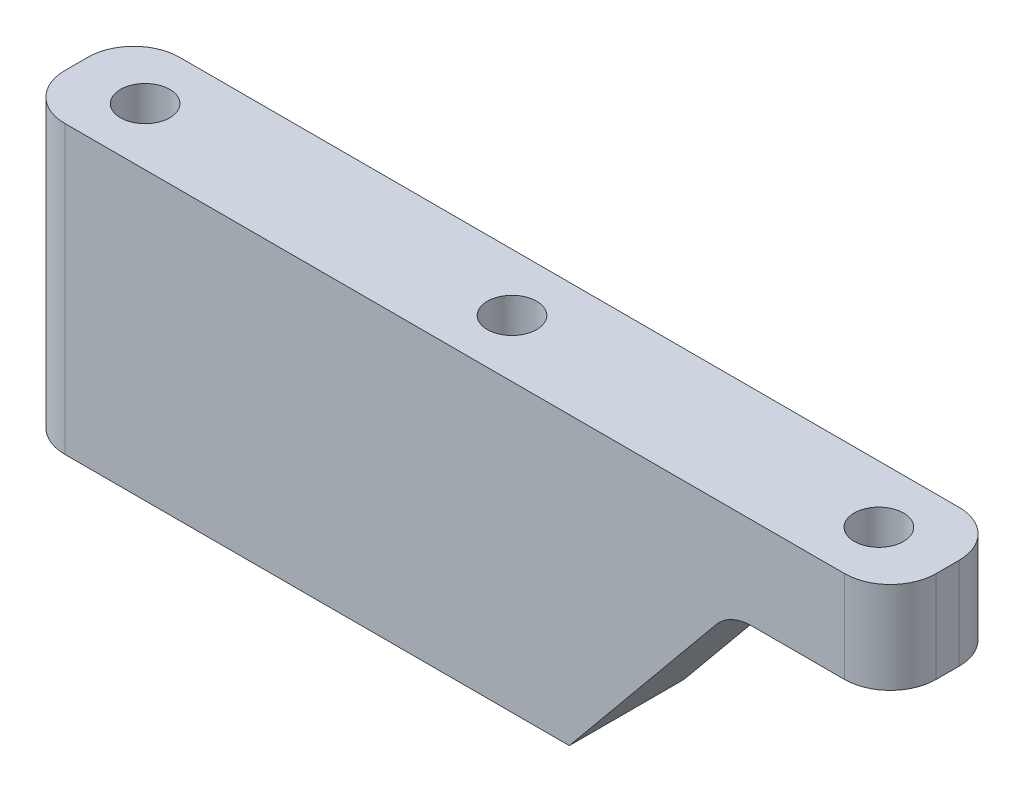
ISO-10303-21;
HEADER;
FILE_DESCRIPTION(('STEP AP214'),'2;1');
FILE_NAME('part.step','',(''),(''),'','','');
FILE_SCHEMA(('AUTOMOTIVE_DESIGN { 1 0 10303 214 1 1 1 1 }'));
ENDSEC;
DATA;
#1=APPLICATION_CONTEXT('core data for automotive mechanical design processes');
#2=APPLICATION_PROTOCOL_DEFINITION('international standard','automotive_design',2000,#1);
#3=PRODUCT_CONTEXT('',#1,'mechanical');
#4=PRODUCT('Part','Part','',(#3));
#5=PRODUCT_RELATED_PRODUCT_CATEGORY('part','',(#4));
#6=PRODUCT_DEFINITION_FORMATION('','',#4);
#7=PRODUCT_DEFINITION_CONTEXT('part definition',#1,'design');
#8=PRODUCT_DEFINITION('design','',#6,#7);
#9=PRODUCT_DEFINITION_SHAPE('','',#8);
#10=(LENGTH_UNIT() NAMED_UNIT(*) SI_UNIT(.MILLI.,.METRE.));
#11=(NAMED_UNIT(*) PLANE_ANGLE_UNIT() SI_UNIT($,.RADIAN.));
#12=(NAMED_UNIT(*) SI_UNIT($,.STERADIAN.) SOLID_ANGLE_UNIT());
#13=UNCERTAINTY_MEASURE_WITH_UNIT(LENGTH_MEASURE(1.E-05),#10,'distance_accuracy_value','');
#14=(GEOMETRIC_REPRESENTATION_CONTEXT(3) GLOBAL_UNCERTAINTY_ASSIGNED_CONTEXT((#13)) GLOBAL_UNIT_ASSIGNED_CONTEXT((#10,
#11,#12)) REPRESENTATION_CONTEXT('',''));
#15=CARTESIAN_POINT('',(0.,0.,0.));
#16=DIRECTION('',(0.,0.,1.));
#17=DIRECTION('',(1.,0.,0.));
#18=AXIS2_PLACEMENT_3D('',#15,#16,#17);
#19=CARTESIAN_POINT('',(0.,25.,0.));
#20=DIRECTION('',(0.,-1.,0.));
#21=DIRECTION('',(0.,0.,-1.));
#22=AXIS2_PLACEMENT_3D('',#19,#20,#21);
#23=PLANE('',#22);
#24=DIRECTION('',(-1.,0.,0.));
#25=VECTOR('',#24,1.);
#26=CARTESIAN_POINT('',(-38.,25.,-5.));
#27=LINE('',#26,#25);
#28=CARTESIAN_POINT('',(34.,25.,-5.));
#29=VERTEX_POINT('',#28);
#30=CARTESIAN_POINT('',(-34.,25.,-5.));
#31=VERTEX_POINT('',#30);
#32=EDGE_CURVE('E178',#29,#31,#27,.T.);
#33=ORIENTED_EDGE('',*,*,#32,.T.);
#34=CARTESIAN_POINT('',(-34.,25.,-1.));
#35=DIRECTION('',(0.,-1.,0.));
#36=DIRECTION('',(0.,0.,-1.));
#37=AXIS2_PLACEMENT_3D('',#34,#35,#36);
#38=CIRCLE('',#37,4.);
#39=CARTESIAN_POINT('',(-38.,25.,-1.));
#40=VERTEX_POINT('',#39);
#41=EDGE_CURVE('E210',#31,#40,#38,.F.);
#42=ORIENTED_EDGE('',*,*,#41,.T.);
#43=DIRECTION('',(0.,0.,1.));
#44=VECTOR('',#43,1.);
#45=CARTESIAN_POINT('',(-38.,25.,5.));
#46=LINE('',#45,#44);
#47=CARTESIAN_POINT('',(-38.,25.,0.999999999999999));
#48=VERTEX_POINT('',#47);
#49=EDGE_CURVE('E181',#40,#48,#46,.T.);
#50=ORIENTED_EDGE('',*,*,#49,.T.);
#51=CARTESIAN_POINT('',(-34.,25.,0.999999999999999));
#52=DIRECTION('',(0.,-1.,0.));
#53=DIRECTION('',(0.,0.,-1.));
#54=AXIS2_PLACEMENT_3D('',#51,#52,#53);
#55=CIRCLE('',#54,4.);
#56=CARTESIAN_POINT('',(-34.,25.,5.));
#57=VERTEX_POINT('',#56);
#58=EDGE_CURVE('E208',#48,#57,#55,.F.);
#59=ORIENTED_EDGE('',*,*,#58,.T.);
#60=DIRECTION('',(1.,0.,0.));
#61=VECTOR('',#60,1.);
#62=CARTESIAN_POINT('',(-38.,25.,5.));
#63=LINE('',#62,#61);
#64=CARTESIAN_POINT('',(34.,25.,5.));
#65=VERTEX_POINT('',#64);
#66=EDGE_CURVE('E184',#57,#65,#63,.T.);
#67=ORIENTED_EDGE('',*,*,#66,.T.);
#68=CARTESIAN_POINT('',(34.,25.,0.999999999999999));
#69=DIRECTION('',(0.,-1.,0.));
#70=DIRECTION('',(0.,0.,-1.));
#71=AXIS2_PLACEMENT_3D('',#68,#69,#70);
#72=CIRCLE('',#71,4.);
#73=CARTESIAN_POINT('',(38.,25.,0.999999999999999));
#74=VERTEX_POINT('',#73);
#75=EDGE_CURVE('E204',#65,#74,#72,.F.);
#76=ORIENTED_EDGE('',*,*,#75,.T.);
#77=DIRECTION('',(0.,0.,-1.));
#78=VECTOR('',#77,1.);
#79=CARTESIAN_POINT('',(38.,25.,5.));
#80=LINE('',#79,#78);
#81=CARTESIAN_POINT('',(38.,25.,-1.));
#82=VERTEX_POINT('',#81);
#83=EDGE_CURVE('E141',#74,#82,#80,.T.);
#84=ORIENTED_EDGE('',*,*,#83,.T.);
#85=CARTESIAN_POINT('',(34.,25.,-1.));
#86=DIRECTION('',(0.,-1.,0.));
#87=DIRECTION('',(0.,0.,-1.));
#88=AXIS2_PLACEMENT_3D('',#85,#86,#87);
#89=CIRCLE('',#88,4.);
#90=EDGE_CURVE('E206',#82,#29,#89,.F.);
#91=ORIENTED_EDGE('',*,*,#90,.T.);
#92=EDGE_LOOP('',(#33,#42,#50,#59,#67,#76,#84,#91));
#93=FACE_BOUND('',#92,.T.);
#94=CARTESIAN_POINT('',(0.,25.,0.));
#95=DIRECTION('',(0.,1.,0.));
#96=DIRECTION('',(0.,0.,1.));
#97=AXIS2_PLACEMENT_3D('',#94,#95,#96);
#98=CIRCLE('',#97,2.15);
#99=CARTESIAN_POINT('',(0.,25.,2.15));
#100=VERTEX_POINT('',#99);
#101=EDGE_CURVE('E171',#100,#100,#98,.T.);
#102=ORIENTED_EDGE('',*,*,#101,.F.);
#103=EDGE_LOOP('',(#102));
#104=FACE_BOUND('',#103,.T.);
#105=CARTESIAN_POINT('',(-32.,25.,0.));
#106=DIRECTION('',(0.,1.,0.));
#107=DIRECTION('',(0.,0.,1.));
#108=AXIS2_PLACEMENT_3D('',#105,#106,#107);
#109=CIRCLE('',#108,2.15);
#110=CARTESIAN_POINT('',(-32.,25.,2.15));
#111=VERTEX_POINT('',#110);
#112=EDGE_CURVE('E165',#111,#111,#109,.T.);
#113=ORIENTED_EDGE('',*,*,#112,.F.);
#114=EDGE_LOOP('',(#113));
#115=FACE_BOUND('',#114,.T.);
#116=CARTESIAN_POINT('',(32.,25.,0.));
#117=DIRECTION('',(0.,1.,0.));
#118=DIRECTION('',(0.,0.,1.));
#119=AXIS2_PLACEMENT_3D('',#116,#117,#118);
#120=CIRCLE('',#119,2.15);
#121=CARTESIAN_POINT('',(32.,25.,2.14999999999999));
#122=VERTEX_POINT('',#121);
#123=EDGE_CURVE('E161',#122,#122,#120,.T.);
#124=ORIENTED_EDGE('',*,*,#123,.F.);
#125=EDGE_LOOP('',(#124));
#126=FACE_BOUND('',#125,.T.);
#127=ADVANCED_FACE('F35',(#93,#104,#115,#126),#23,.F.);
#128=CARTESIAN_POINT('',(0.,0.,0.));
#129=DIRECTION('',(0.,-1.,0.));
#130=DIRECTION('',(0.,0.,-1.));
#131=AXIS2_PLACEMENT_3D('',#128,#129,#130);
#132=PLANE('',#131);
#133=DIRECTION('',(0.,0.,1.));
#134=VECTOR('',#133,1.);
#135=CARTESIAN_POINT('',(-38.,0.,5.));
#136=LINE('',#135,#134);
#137=CARTESIAN_POINT('',(-38.,0.,-1.));
#138=VERTEX_POINT('',#137);
#139=CARTESIAN_POINT('',(-38.,0.,0.999999999999999));
#140=VERTEX_POINT('',#139);
#141=EDGE_CURVE('E142',#138,#140,#136,.T.);
#142=ORIENTED_EDGE('',*,*,#141,.F.);
#143=CARTESIAN_POINT('',(-34.,0.,-1.));
#144=DIRECTION('',(0.,-1.,0.));
#145=DIRECTION('',(0.,0.,-1.));
#146=AXIS2_PLACEMENT_3D('',#143,#144,#145);
#147=CIRCLE('',#146,4.);
#148=CARTESIAN_POINT('',(-34.,0.,-5.));
#149=VERTEX_POINT('',#148);
#150=EDGE_CURVE('E197',#138,#149,#147,.T.);
#151=ORIENTED_EDGE('',*,*,#150,.T.);
#152=DIRECTION('',(-1.,0.,0.));
#153=VECTOR('',#152,1.);
#154=CARTESIAN_POINT('',(-38.,0.,-5.));
#155=LINE('',#154,#153);
#156=CARTESIAN_POINT('',(10.,0.,-5.));
#157=VERTEX_POINT('',#156);
#158=EDGE_CURVE('E148',#157,#149,#155,.T.);
#159=ORIENTED_EDGE('',*,*,#158,.F.);
#160=DIRECTION('',(0.,0.,1.));
#161=VECTOR('',#160,1.);
#162=CARTESIAN_POINT('',(10.,0.,-22.));
#163=LINE('',#162,#161);
#164=CARTESIAN_POINT('',(10.,0.,5.));
#165=VERTEX_POINT('',#164);
#166=EDGE_CURVE('E125',#157,#165,#163,.T.);
#167=ORIENTED_EDGE('',*,*,#166,.T.);
#168=DIRECTION('',(1.,0.,0.));
#169=VECTOR('',#168,1.);
#170=CARTESIAN_POINT('',(-38.,0.,5.));
#171=LINE('',#170,#169);
#172=CARTESIAN_POINT('',(-34.,0.,5.));
#173=VERTEX_POINT('',#172);
#174=EDGE_CURVE('E135',#173,#165,#171,.T.);
#175=ORIENTED_EDGE('',*,*,#174,.F.);
#176=CARTESIAN_POINT('',(-34.,0.,0.999999999999999));
#177=DIRECTION('',(0.,-1.,0.));
#178=DIRECTION('',(0.,0.,-1.));
#179=AXIS2_PLACEMENT_3D('',#176,#177,#178);
#180=CIRCLE('',#179,4.);
#181=EDGE_CURVE('E195',#173,#140,#180,.T.);
#182=ORIENTED_EDGE('',*,*,#181,.T.);
#183=EDGE_LOOP('',(#142,#151,#159,#167,#175,#182));
#184=FACE_BOUND('',#183,.T.);
#185=CARTESIAN_POINT('',(-32.,0.,0.));
#186=DIRECTION('',(0.,1.,0.));
#187=DIRECTION('',(0.,0.,1.));
#188=AXIS2_PLACEMENT_3D('',#185,#186,#187);
#189=CIRCLE('',#188,2.15);
#190=CARTESIAN_POINT('',(-32.,0.,2.15));
#191=VERTEX_POINT('',#190);
#192=EDGE_CURVE('E164',#191,#191,#189,.T.);
#193=ORIENTED_EDGE('',*,*,#192,.T.);
#194=EDGE_LOOP('',(#193));
#195=FACE_BOUND('',#194,.T.);
#196=CARTESIAN_POINT('',(0.,0.,0.));
#197=DIRECTION('',(0.,1.,0.));
#198=DIRECTION('',(0.,0.,1.));
#199=AXIS2_PLACEMENT_3D('',#196,#197,#198);
#200=CIRCLE('',#199,2.15);
#201=CARTESIAN_POINT('',(0.,0.,2.15));
#202=VERTEX_POINT('',#201);
#203=EDGE_CURVE('E168',#202,#202,#200,.T.);
#204=ORIENTED_EDGE('',*,*,#203,.T.);
#205=EDGE_LOOP('',(#204));
#206=FACE_BOUND('',#205,.T.);
#207=ADVANCED_FACE('F145',(#184,#195,#206),#132,.T.);
#208=CARTESIAN_POINT('',(38.,25.,5.));
#209=DIRECTION('',(-1.,0.,0.));
#210=DIRECTION('',(0.,0.,1.));
#211=AXIS2_PLACEMENT_3D('',#208,#209,#210);
#212=PLANE('',#211);
#213=DIRECTION('',(0.,0.,1.));
#214=VECTOR('',#213,1.);
#215=CARTESIAN_POINT('',(38.,17.,-22.));
#216=LINE('',#215,#214);
#217=CARTESIAN_POINT('',(38.,17.,-1.));
#218=VERTEX_POINT('',#217);
#219=CARTESIAN_POINT('',(38.,17.,1.));
#220=VERTEX_POINT('',#219);
#221=EDGE_CURVE('E130',#218,#220,#216,.T.);
#222=ORIENTED_EDGE('',*,*,#221,.F.);
#223=DIRECTION('',(0.,-1.,0.));
#224=VECTOR('',#223,1.);
#225=CARTESIAN_POINT('',(38.,25.,-1.));
#226=LINE('',#225,#224);
#227=EDGE_CURVE('E221',#218,#82,#226,.F.);
#228=ORIENTED_EDGE('',*,*,#227,.T.);
#229=ORIENTED_EDGE('',*,*,#83,.F.);
#230=DIRECTION('',(0.,-1.,0.));
#231=VECTOR('',#230,1.);
#232=CARTESIAN_POINT('',(38.,25.,0.999999999999999));
#233=LINE('',#232,#231);
#234=EDGE_CURVE('E219',#74,#220,#233,.T.);
#235=ORIENTED_EDGE('',*,*,#234,.T.);
#236=EDGE_LOOP('',(#222,#228,#229,#235));
#237=FACE_BOUND('',#236,.T.);
#238=ADVANCED_FACE('F239',(#237),#212,.F.);
#239=CARTESIAN_POINT('',(-38.,25.,-5.));
#240=DIRECTION('',(0.,0.,1.));
#241=DIRECTION('',(1.,0.,0.));
#242=AXIS2_PLACEMENT_3D('',#239,#240,#241);
#243=PLANE('',#242);
#244=ORIENTED_EDGE('',*,*,#158,.T.);
#245=DIRECTION('',(0.,-1.,0.));
#246=VECTOR('',#245,1.);
#247=CARTESIAN_POINT('',(-34.,25.,-5.));
#248=LINE('',#247,#246);
#249=EDGE_CURVE('E202',#149,#31,#248,.F.);
#250=ORIENTED_EDGE('',*,*,#249,.T.);
#251=ORIENTED_EDGE('',*,*,#32,.F.);
#252=DIRECTION('',(0.,-1.,0.));
#253=VECTOR('',#252,1.);
#254=CARTESIAN_POINT('',(34.,25.,-5.));
#255=LINE('',#254,#253);
#256=CARTESIAN_POINT('',(34.,17.,-5.));
#257=VERTEX_POINT('',#256);
#258=EDGE_CURVE('E199',#29,#257,#255,.T.);
#259=ORIENTED_EDGE('',*,*,#258,.T.);
#260=DIRECTION('',(-1.,0.,0.));
#261=VECTOR('',#260,1.);
#262=CARTESIAN_POINT('',(-38.,17.,-5.));
#263=LINE('',#262,#261);
#264=CARTESIAN_POINT('',(25.8876977754224,17.,-5.));
#265=VERTEX_POINT('',#264);
#266=EDGE_CURVE('E152',#257,#265,#263,.T.);
#267=ORIENTED_EDGE('',*,*,#266,.T.);
#268=CARTESIAN_POINT('',(25.8876977754224,13.,-5.));
#269=DIRECTION('',(0.,0.,1.));
#270=DIRECTION('',(1.,0.,0.));
#271=AXIS2_PLACEMENT_3D('',#268,#269,#270);
#272=CIRCLE('',#271,4.);
#273=CARTESIAN_POINT('',(22.7999768329542,15.5428290114444,-5.));
#274=VERTEX_POINT('',#273);
#275=EDGE_CURVE('E11',#265,#274,#272,.T.);
#276=ORIENTED_EDGE('',*,*,#275,.T.);
#277=DIRECTION('',(-0.635707252861101,-0.771930235617049,0.));
#278=VECTOR('',#277,1.);
#279=CARTESIAN_POINT('',(2.87010309278347,-8.65773195876291,-5.));
#280=LINE('',#279,#278);
#281=EDGE_CURVE('E159',#274,#157,#280,.T.);
#282=ORIENTED_EDGE('',*,*,#281,.T.);
#283=EDGE_LOOP('',(#244,#250,#251,#259,#267,#276,#282));
#284=FACE_BOUND('',#283,.T.);
#285=ADVANCED_FACE('F230',(#284),#243,.F.);
#286=CARTESIAN_POINT('',(-38.,25.,5.));
#287=DIRECTION('',(1.,0.,0.));
#288=DIRECTION('',(0.,0.,-1.));
#289=AXIS2_PLACEMENT_3D('',#286,#287,#288);
#290=PLANE('',#289);
#291=ORIENTED_EDGE('',*,*,#49,.F.);
#292=DIRECTION('',(0.,-1.,0.));
#293=VECTOR('',#292,1.);
#294=CARTESIAN_POINT('',(-38.,25.,-1.));
#295=LINE('',#294,#293);
#296=EDGE_CURVE('E192',#40,#138,#295,.T.);
#297=ORIENTED_EDGE('',*,*,#296,.T.);
#298=ORIENTED_EDGE('',*,*,#141,.T.);
#299=DIRECTION('',(0.,-1.,0.));
#300=VECTOR('',#299,1.);
#301=CARTESIAN_POINT('',(-38.,25.,0.999999999999999));
#302=LINE('',#301,#300);
#303=EDGE_CURVE('E187',#140,#48,#302,.F.);
#304=ORIENTED_EDGE('',*,*,#303,.T.);
#305=EDGE_LOOP('',(#291,#297,#298,#304));
#306=FACE_BOUND('',#305,.T.);
#307=ADVANCED_FACE('F250',(#306),#290,.F.);
#308=CARTESIAN_POINT('',(-38.,25.,5.));
#309=DIRECTION('',(0.,0.,-1.));
#310=DIRECTION('',(-1.,0.,0.));
#311=AXIS2_PLACEMENT_3D('',#308,#309,#310);
#312=PLANE('',#311);
#313=ORIENTED_EDGE('',*,*,#66,.F.);
#314=DIRECTION('',(0.,-1.,0.));
#315=VECTOR('',#314,1.);
#316=CARTESIAN_POINT('',(-34.,25.,5.));
#317=LINE('',#316,#315);
#318=EDGE_CURVE('E139',#57,#173,#317,.T.);
#319=ORIENTED_EDGE('',*,*,#318,.T.);
#320=ORIENTED_EDGE('',*,*,#174,.T.);
#321=DIRECTION('',(-0.635707252861101,-0.771930235617049,0.));
#322=VECTOR('',#321,1.);
#323=CARTESIAN_POINT('',(24.,17.,5.));
#324=LINE('',#323,#322);
#325=CARTESIAN_POINT('',(22.7999768329542,15.5428290114444,5.));
#326=VERTEX_POINT('',#325);
#327=EDGE_CURVE('E120',#326,#165,#324,.T.);
#328=ORIENTED_EDGE('',*,*,#327,.F.);
#329=CARTESIAN_POINT('',(25.8876977754224,13.,5.));
#330=DIRECTION('',(0.,0.,-1.));
#331=DIRECTION('',(-1.,0.,0.));
#332=AXIS2_PLACEMENT_3D('',#329,#330,#331);
#333=CIRCLE('',#332,4.);
#334=CARTESIAN_POINT('',(25.8876977754224,17.,5.));
#335=VERTEX_POINT('',#334);
#336=EDGE_CURVE('E43',#326,#335,#333,.T.);
#337=ORIENTED_EDGE('',*,*,#336,.T.);
#338=DIRECTION('',(-1.,0.,0.));
#339=VECTOR('',#338,1.);
#340=CARTESIAN_POINT('',(38.,17.,5.));
#341=LINE('',#340,#339);
#342=CARTESIAN_POINT('',(34.,17.,5.));
#343=VERTEX_POINT('',#342);
#344=EDGE_CURVE('E131',#343,#335,#341,.T.);
#345=ORIENTED_EDGE('',*,*,#344,.F.);
#346=DIRECTION('',(0.,-1.,0.));
#347=VECTOR('',#346,1.);
#348=CARTESIAN_POINT('',(34.,25.,5.));
#349=LINE('',#348,#347);
#350=EDGE_CURVE('E212',#343,#65,#349,.F.);
#351=ORIENTED_EDGE('',*,*,#350,.T.);
#352=EDGE_LOOP('',(#313,#319,#320,#328,#337,#345,#351));
#353=FACE_BOUND('',#352,.T.);
#354=ADVANCED_FACE('F137',(#353),#312,.F.);
#355=CARTESIAN_POINT('',(0.,25.,0.));
#356=DIRECTION('',(0.,-1.,0.));
#357=DIRECTION('',(0.,0.,-1.));
#358=AXIS2_PLACEMENT_3D('',#355,#356,#357);
#359=CYLINDRICAL_SURFACE('',#358,2.15);
#360=ORIENTED_EDGE('',*,*,#101,.T.);
#361=EDGE_LOOP('',(#360));
#362=FACE_BOUND('',#361,.T.);
#363=ORIENTED_EDGE('',*,*,#203,.F.);
#364=EDGE_LOOP('',(#363));
#365=FACE_BOUND('',#364,.T.);
#366=ADVANCED_FACE('F273',(#362,#365),#359,.F.);
#367=CARTESIAN_POINT('',(-32.,25.,0.));
#368=DIRECTION('',(0.,-1.,0.));
#369=DIRECTION('',(0.,0.,-1.));
#370=AXIS2_PLACEMENT_3D('',#367,#368,#369);
#371=CYLINDRICAL_SURFACE('',#370,2.15);
#372=ORIENTED_EDGE('',*,*,#112,.T.);
#373=EDGE_LOOP('',(#372));
#374=FACE_BOUND('',#373,.T.);
#375=ORIENTED_EDGE('',*,*,#192,.F.);
#376=EDGE_LOOP('',(#375));
#377=FACE_BOUND('',#376,.T.);
#378=ADVANCED_FACE('F305',(#374,#377),#371,.F.);
#379=CARTESIAN_POINT('',(32.,25.,0.));
#380=DIRECTION('',(0.,-1.,0.));
#381=DIRECTION('',(0.,0.,-1.));
#382=AXIS2_PLACEMENT_3D('',#379,#380,#381);
#383=CYLINDRICAL_SURFACE('',#382,2.15);
#384=CARTESIAN_POINT('',(32.,17.,0.));
#385=DIRECTION('',(0.,1.,0.));
#386=DIRECTION('',(0.,0.,1.));
#387=AXIS2_PLACEMENT_3D('',#384,#385,#386);
#388=CIRCLE('',#387,2.15);
#389=CARTESIAN_POINT('',(32.,17.,2.14999999999999));
#390=VERTEX_POINT('',#389);
#391=EDGE_CURVE('E149',#390,#390,#388,.T.);
#392=ORIENTED_EDGE('',*,*,#391,.F.);
#393=EDGE_LOOP('',(#392));
#394=FACE_BOUND('',#393,.T.);
#395=ORIENTED_EDGE('',*,*,#123,.T.);
#396=EDGE_LOOP('',(#395));
#397=FACE_BOUND('',#396,.T.);
#398=ADVANCED_FACE('F312',(#394,#397),#383,.F.);
#399=CARTESIAN_POINT('',(24.,17.,-22.));
#400=DIRECTION('',(-0.771930235617049,0.635707252861101,0.));
#401=DIRECTION('',(-0.635707252861101,-0.771930235617049,0.));
#402=AXIS2_PLACEMENT_3D('',#399,#400,#401);
#403=PLANE('',#402);
#404=ORIENTED_EDGE('',*,*,#281,.F.);
#405=DIRECTION('',(0.,0.,1.));
#406=VECTOR('',#405,1.);
#407=CARTESIAN_POINT('',(22.7999768329542,15.5428290114444,5.));
#408=LINE('',#407,#406);
#409=EDGE_CURVE('E128',#274,#326,#408,.T.);
#410=ORIENTED_EDGE('',*,*,#409,.T.);
#411=ORIENTED_EDGE('',*,*,#327,.T.);
#412=ORIENTED_EDGE('',*,*,#166,.F.);
#413=EDGE_LOOP('',(#404,#410,#411,#412));
#414=FACE_BOUND('',#413,.T.);
#415=ADVANCED_FACE('F123',(#414),#403,.F.);
#416=CARTESIAN_POINT('',(38.,17.,-22.));
#417=DIRECTION('',(0.,1.,0.));
#418=DIRECTION('',(0.,0.,1.));
#419=AXIS2_PLACEMENT_3D('',#416,#417,#418);
#420=PLANE('',#419);
#421=ORIENTED_EDGE('',*,*,#391,.T.);
#422=EDGE_LOOP('',(#421));
#423=FACE_BOUND('',#422,.T.);
#424=ORIENTED_EDGE('',*,*,#266,.F.);
#425=CARTESIAN_POINT('',(34.,17.,-1.));
#426=DIRECTION('',(0.,1.,0.));
#427=DIRECTION('',(0.,0.,1.));
#428=AXIS2_PLACEMENT_3D('',#425,#426,#427);
#429=CIRCLE('',#428,4.);
#430=EDGE_CURVE('E58',#257,#218,#429,.F.);
#431=ORIENTED_EDGE('',*,*,#430,.T.);
#432=ORIENTED_EDGE('',*,*,#221,.T.);
#433=CARTESIAN_POINT('',(34.,17.,0.999999999999999));
#434=DIRECTION('',(0.,1.,0.));
#435=DIRECTION('',(0.,0.,1.));
#436=AXIS2_PLACEMENT_3D('',#433,#434,#435);
#437=CIRCLE('',#436,4.);
#438=EDGE_CURVE('E50',#220,#343,#437,.F.);
#439=ORIENTED_EDGE('',*,*,#438,.T.);
#440=ORIENTED_EDGE('',*,*,#344,.T.);
#441=DIRECTION('',(0.,0.,1.));
#442=VECTOR('',#441,1.);
#443=CARTESIAN_POINT('',(25.8876977754224,17.,-5.));
#444=LINE('',#443,#442);
#445=EDGE_CURVE('E215',#335,#265,#444,.F.);
#446=ORIENTED_EDGE('',*,*,#445,.T.);
#447=EDGE_LOOP('',(#424,#431,#432,#439,#440,#446));
#448=FACE_BOUND('',#447,.T.);
#449=ADVANCED_FACE('F227',(#423,#448),#420,.F.);
#450=CARTESIAN_POINT('',(-34.,25.,-1.));
#451=DIRECTION('',(0.,-1.,0.));
#452=DIRECTION('',(0.,0.,-1.));
#453=AXIS2_PLACEMENT_3D('',#450,#451,#452);
#454=CYLINDRICAL_SURFACE('',#453,4.);
#455=ORIENTED_EDGE('',*,*,#41,.F.);
#456=ORIENTED_EDGE('',*,*,#249,.F.);
#457=ORIENTED_EDGE('',*,*,#150,.F.);
#458=ORIENTED_EDGE('',*,*,#296,.F.);
#459=EDGE_LOOP('',(#455,#456,#457,#458));
#460=FACE_BOUND('',#459,.T.);
#461=ADVANCED_FACE('F254',(#460),#454,.T.);
#462=CARTESIAN_POINT('',(-34.,25.,0.999999999999999));
#463=DIRECTION('',(0.,-1.,0.));
#464=DIRECTION('',(0.,0.,-1.));
#465=AXIS2_PLACEMENT_3D('',#462,#463,#464);
#466=CYLINDRICAL_SURFACE('',#465,4.);
#467=ORIENTED_EDGE('',*,*,#58,.F.);
#468=ORIENTED_EDGE('',*,*,#303,.F.);
#469=ORIENTED_EDGE('',*,*,#181,.F.);
#470=ORIENTED_EDGE('',*,*,#318,.F.);
#471=EDGE_LOOP('',(#467,#468,#469,#470));
#472=FACE_BOUND('',#471,.T.);
#473=ADVANCED_FACE('F246',(#472),#466,.T.);
#474=CARTESIAN_POINT('',(34.,25.,-1.));
#475=DIRECTION('',(0.,-1.,0.));
#476=DIRECTION('',(0.,0.,-1.));
#477=AXIS2_PLACEMENT_3D('',#474,#475,#476);
#478=CYLINDRICAL_SURFACE('',#477,4.);
#479=ORIENTED_EDGE('',*,*,#90,.F.);
#480=ORIENTED_EDGE('',*,*,#227,.F.);
#481=ORIENTED_EDGE('',*,*,#430,.F.);
#482=ORIENTED_EDGE('',*,*,#258,.F.);
#483=EDGE_LOOP('',(#479,#480,#481,#482));
#484=FACE_BOUND('',#483,.T.);
#485=ADVANCED_FACE('F235',(#484),#478,.T.);
#486=CARTESIAN_POINT('',(34.,25.,0.999999999999999));
#487=DIRECTION('',(0.,-1.,0.));
#488=DIRECTION('',(0.,0.,-1.));
#489=AXIS2_PLACEMENT_3D('',#486,#487,#488);
#490=CYLINDRICAL_SURFACE('',#489,4.);
#491=ORIENTED_EDGE('',*,*,#75,.F.);
#492=ORIENTED_EDGE('',*,*,#350,.F.);
#493=ORIENTED_EDGE('',*,*,#438,.F.);
#494=ORIENTED_EDGE('',*,*,#234,.F.);
#495=EDGE_LOOP('',(#491,#492,#493,#494));
#496=FACE_BOUND('',#495,.T.);
#497=ADVANCED_FACE('F243',(#496),#490,.T.);
#498=CARTESIAN_POINT('',(25.8876977754224,13.,-22.));
#499=DIRECTION('',(0.,0.,-1.));
#500=DIRECTION('',(-1.,0.,0.));
#501=AXIS2_PLACEMENT_3D('',#498,#499,#500);
#502=CYLINDRICAL_SURFACE('',#501,4.);
#503=ORIENTED_EDGE('',*,*,#275,.F.);
#504=ORIENTED_EDGE('',*,*,#445,.F.);
#505=ORIENTED_EDGE('',*,*,#336,.F.);
#506=ORIENTED_EDGE('',*,*,#409,.F.);
#507=EDGE_LOOP('',(#503,#504,#505,#506));
#508=FACE_BOUND('',#507,.T.);
#509=ADVANCED_FACE('F37',(#508),#502,.F.);
#510=CLOSED_SHELL('',(#127,#207,#238,#285,#307,#354,#366,#378,#398,#415,#449,#461,#473,#485,
#497,#509));
#511=MANIFOLD_SOLID_BREP('B2',#510);
#512=ADVANCED_BREP_SHAPE_REPRESENTATION('',(#18,#511),#14);
#513=SHAPE_DEFINITION_REPRESENTATION(#9,#512);
ENDSEC;
END-ISO-10303-21;
